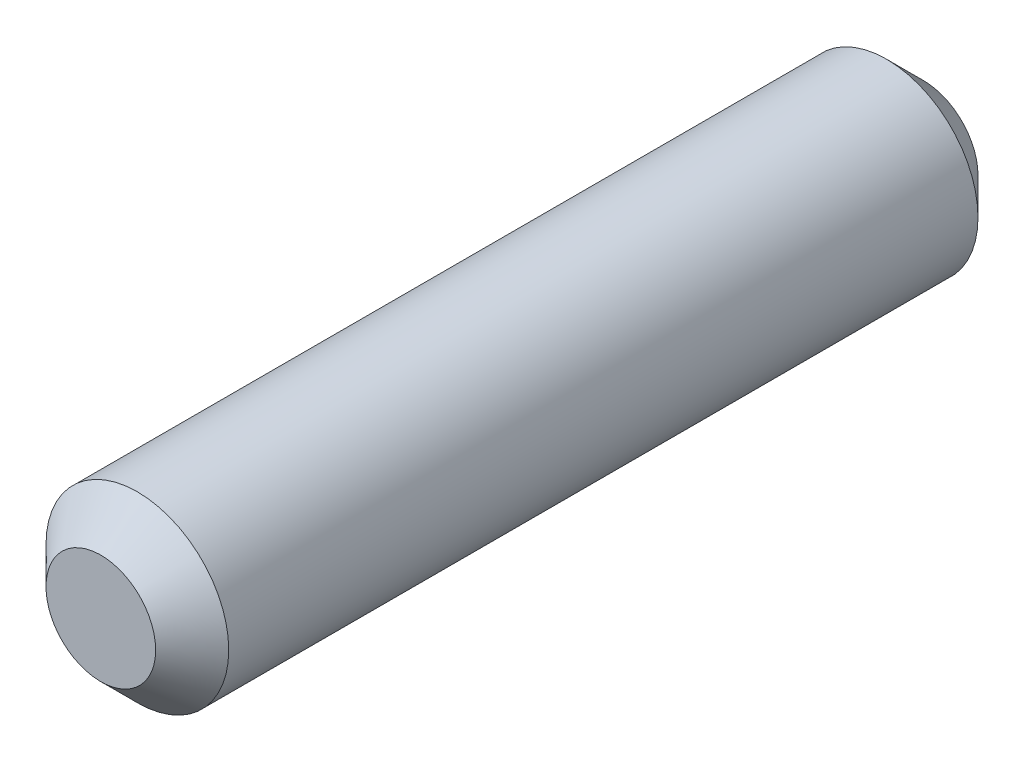
ISO-10303-21;
HEADER;
FILE_DESCRIPTION(('STEP AP214'),'2;1');
FILE_NAME('part.step','',(''),(''),'','','');
FILE_SCHEMA(('AUTOMOTIVE_DESIGN { 1 0 10303 214 1 1 1 1 }'));
ENDSEC;
DATA;
#1=APPLICATION_CONTEXT('core data for automotive mechanical design processes');
#2=APPLICATION_PROTOCOL_DEFINITION('international standard','automotive_design',2000,#1);
#3=PRODUCT_CONTEXT('',#1,'mechanical');
#4=PRODUCT('Part','Part','',(#3));
#5=PRODUCT_RELATED_PRODUCT_CATEGORY('part','',(#4));
#6=PRODUCT_DEFINITION_FORMATION('','',#4);
#7=PRODUCT_DEFINITION_CONTEXT('part definition',#1,'design');
#8=PRODUCT_DEFINITION('design','',#6,#7);
#9=PRODUCT_DEFINITION_SHAPE('','',#8);
#10=(LENGTH_UNIT() NAMED_UNIT(*) SI_UNIT(.MILLI.,.METRE.));
#11=(NAMED_UNIT(*) PLANE_ANGLE_UNIT() SI_UNIT($,.RADIAN.));
#12=(NAMED_UNIT(*) SI_UNIT($,.STERADIAN.) SOLID_ANGLE_UNIT());
#13=UNCERTAINTY_MEASURE_WITH_UNIT(LENGTH_MEASURE(1.E-05),#10,'distance_accuracy_value','');
#14=(GEOMETRIC_REPRESENTATION_CONTEXT(3) GLOBAL_UNCERTAINTY_ASSIGNED_CONTEXT((#13)) GLOBAL_UNIT_ASSIGNED_CONTEXT((#10,
#11,#12)) REPRESENTATION_CONTEXT('',''));
#15=CARTESIAN_POINT('',(0.,0.,0.));
#16=DIRECTION('',(0.,0.,1.));
#17=DIRECTION('',(1.,0.,0.));
#18=AXIS2_PLACEMENT_3D('',#15,#16,#17);
#19=CARTESIAN_POINT('',(0.,0.,45.));
#20=DIRECTION('',(0.,0.,-1.));
#21=DIRECTION('',(-1.,0.,0.));
#22=AXIS2_PLACEMENT_3D('',#19,#20,#21);
#23=CYLINDRICAL_SURFACE('',#22,5.);
#24=CARTESIAN_POINT('',(0.,0.,2.00000000000002));
#25=DIRECTION('',(0.,0.,1.));
#26=DIRECTION('',(1.,0.,0.));
#27=AXIS2_PLACEMENT_3D('',#24,#25,#26);
#28=CIRCLE('',#27,5.);
#29=CARTESIAN_POINT('',(5.,0.,2.00000000000002));
#30=VERTEX_POINT('',#29);
#31=EDGE_CURVE('E42',#30,#30,#28,.T.);
#32=ORIENTED_EDGE('',*,*,#31,.T.);
#33=EDGE_LOOP('',(#32));
#34=FACE_BOUND('',#33,.T.);
#35=CARTESIAN_POINT('',(0.,0.,43.));
#36=DIRECTION('',(0.,0.,1.));
#37=DIRECTION('',(1.,0.,0.));
#38=AXIS2_PLACEMENT_3D('',#35,#36,#37);
#39=CIRCLE('',#38,5.);
#40=CARTESIAN_POINT('',(5.,0.,43.));
#41=VERTEX_POINT('',#40);
#42=EDGE_CURVE('E46',#41,#41,#39,.F.);
#43=ORIENTED_EDGE('',*,*,#42,.T.);
#44=EDGE_LOOP('',(#43));
#45=FACE_BOUND('',#44,.T.);
#46=ADVANCED_FACE('F31',(#34,#45),#23,.T.);
#47=CARTESIAN_POINT('',(0.,0.,45.));
#48=DIRECTION('',(0.,0.,1.));
#49=DIRECTION('',(1.,0.,0.));
#50=AXIS2_PLACEMENT_3D('',#47,#48,#49);
#51=PLANE('',#50);
#52=CARTESIAN_POINT('',(0.,0.,45.));
#53=DIRECTION('',(0.,0.,1.));
#54=DIRECTION('',(1.,0.,0.));
#55=AXIS2_PLACEMENT_3D('',#52,#53,#54);
#56=CIRCLE('',#55,3.00000000000002);
#57=CARTESIAN_POINT('',(3.00000000000002,0.,45.));
#58=VERTEX_POINT('',#57);
#59=EDGE_CURVE('E10',#58,#58,#56,.T.);
#60=ORIENTED_EDGE('',*,*,#59,.T.);
#61=EDGE_LOOP('',(#60));
#62=FACE_BOUND('',#61,.T.);
#63=ADVANCED_FACE('F62',(#62),#51,.T.);
#64=CARTESIAN_POINT('',(0.,0.,0.));
#65=DIRECTION('',(0.,0.,1.));
#66=DIRECTION('',(1.,0.,0.));
#67=AXIS2_PLACEMENT_3D('',#64,#65,#66);
#68=PLANE('',#67);
#69=CARTESIAN_POINT('',(0.,0.,0.));
#70=DIRECTION('',(0.,0.,1.));
#71=DIRECTION('',(1.,0.,0.));
#72=AXIS2_PLACEMENT_3D('',#69,#70,#71);
#73=CIRCLE('',#72,2.99999999999997);
#74=CARTESIAN_POINT('',(2.99999999999997,0.,0.));
#75=VERTEX_POINT('',#74);
#76=EDGE_CURVE('E38',#75,#75,#73,.F.);
#77=ORIENTED_EDGE('',*,*,#76,.T.);
#78=EDGE_LOOP('',(#77));
#79=FACE_BOUND('',#78,.T.);
#80=ADVANCED_FACE('F59',(#79),#68,.F.);
#81=CARTESIAN_POINT('',(0.,0.,2.00000000000002));
#82=DIRECTION('',(0.,0.,1.));
#83=DIRECTION('',(1.,0.,0.));
#84=AXIS2_PLACEMENT_3D('',#81,#82,#83);
#85=CONICAL_SURFACE('',#84,5.,0.785398163397451);
#86=ORIENTED_EDGE('',*,*,#76,.F.);
#87=EDGE_LOOP('',(#86));
#88=FACE_BOUND('',#87,.T.);
#89=ORIENTED_EDGE('',*,*,#31,.F.);
#90=EDGE_LOOP('',(#89));
#91=FACE_BOUND('',#90,.T.);
#92=ADVANCED_FACE('F55',(#88,#91),#85,.T.);
#93=CARTESIAN_POINT('',(0.,0.,45.));
#94=DIRECTION('',(0.,0.,-1.));
#95=DIRECTION('',(-1.,0.,0.));
#96=AXIS2_PLACEMENT_3D('',#93,#94,#95);
#97=CONICAL_SURFACE('',#96,3.00000000000002,0.785398163397447);
#98=ORIENTED_EDGE('',*,*,#42,.F.);
#99=EDGE_LOOP('',(#98));
#100=FACE_BOUND('',#99,.T.);
#101=ORIENTED_EDGE('',*,*,#59,.F.);
#102=EDGE_LOOP('',(#101));
#103=FACE_BOUND('',#102,.T.);
#104=ADVANCED_FACE('F33',(#100,#103),#97,.T.);
#105=CLOSED_SHELL('',(#46,#63,#80,#92,#104));
#106=MANIFOLD_SOLID_BREP('B2',#105);
#107=ADVANCED_BREP_SHAPE_REPRESENTATION('',(#18,#106),#14);
#108=SHAPE_DEFINITION_REPRESENTATION(#9,#107);
ENDSEC;
END-ISO-10303-21;
